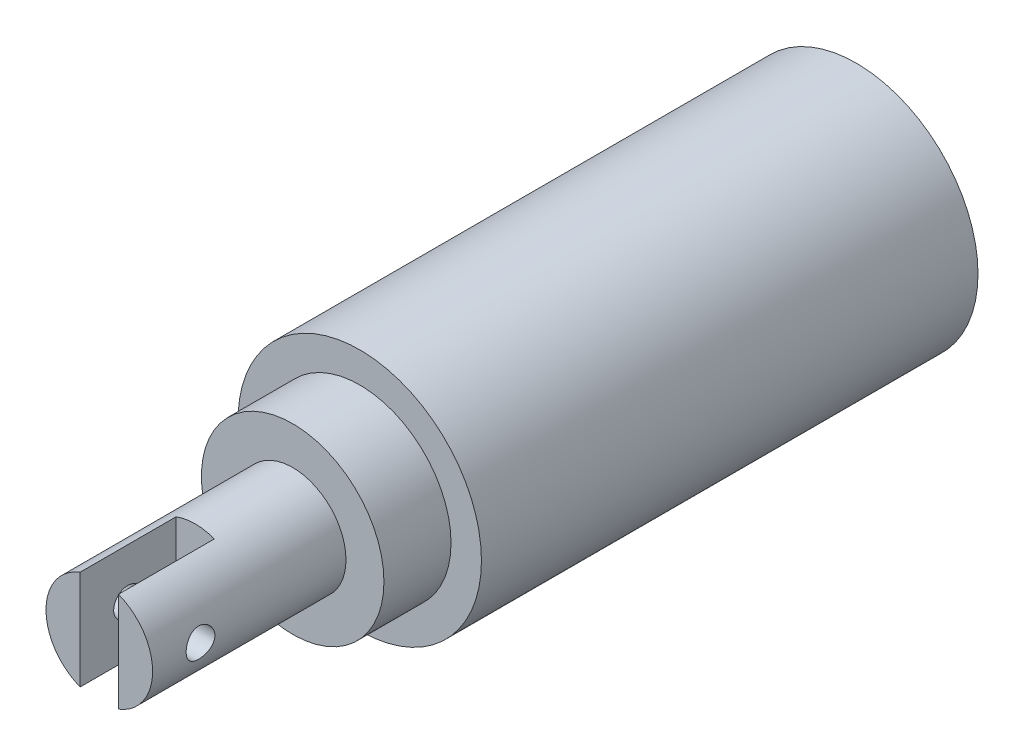
ISO-10303-21;
HEADER;
FILE_DESCRIPTION(('STEP AP214'),'2;1');
FILE_NAME('part.step','',(''),(''),'','','');
FILE_SCHEMA(('AUTOMOTIVE_DESIGN { 1 0 10303 214 1 1 1 1 }'));
ENDSEC;
DATA;
#1=APPLICATION_CONTEXT('core data for automotive mechanical design processes');
#2=APPLICATION_PROTOCOL_DEFINITION('international standard','automotive_design',2000,#1);
#3=PRODUCT_CONTEXT('',#1,'mechanical');
#4=PRODUCT('Part','Part','',(#3));
#5=PRODUCT_RELATED_PRODUCT_CATEGORY('part','',(#4));
#6=PRODUCT_DEFINITION_FORMATION('','',#4);
#7=PRODUCT_DEFINITION_CONTEXT('part definition',#1,'design');
#8=PRODUCT_DEFINITION('design','',#6,#7);
#9=PRODUCT_DEFINITION_SHAPE('','',#8);
#10=(LENGTH_UNIT() NAMED_UNIT(*) SI_UNIT(.MILLI.,.METRE.));
#11=(NAMED_UNIT(*) PLANE_ANGLE_UNIT() SI_UNIT($,.RADIAN.));
#12=(NAMED_UNIT(*) SI_UNIT($,.STERADIAN.) SOLID_ANGLE_UNIT());
#13=UNCERTAINTY_MEASURE_WITH_UNIT(LENGTH_MEASURE(1.E-05),#10,'distance_accuracy_value','');
#14=(GEOMETRIC_REPRESENTATION_CONTEXT(3) GLOBAL_UNCERTAINTY_ASSIGNED_CONTEXT((#13)) GLOBAL_UNIT_ASSIGNED_CONTEXT((#10,
#11,#12)) REPRESENTATION_CONTEXT('',''));
#15=CARTESIAN_POINT('',(0.,0.,0.));
#16=DIRECTION('',(0.,0.,1.));
#17=DIRECTION('',(1.,0.,0.));
#18=AXIS2_PLACEMENT_3D('',#15,#16,#17);
#19=CARTESIAN_POINT('',(0.,0.,78.994));
#20=DIRECTION('',(0.,0.,1.));
#21=DIRECTION('',(1.,0.,0.));
#22=AXIS2_PLACEMENT_3D('',#19,#20,#21);
#23=PLANE('',#22);
#24=DIRECTION('',(0.,1.,0.));
#25=VECTOR('',#24,1.);
#26=CARTESIAN_POINT('',(2.,0.,78.994));
#27=LINE('',#26,#25);
#28=CARTESIAN_POINT('',(2.,-5.19061834081452,78.994));
#29=VERTEX_POINT('',#28);
#30=CARTESIAN_POINT('',(2.,5.19061834081451,78.994));
#31=VERTEX_POINT('',#30);
#32=EDGE_CURVE('E81',#29,#31,#27,.T.);
#33=ORIENTED_EDGE('',*,*,#32,.F.);
#34=CARTESIAN_POINT('',(0.,0.,78.994));
#35=DIRECTION('',(0.,0.,1.));
#36=DIRECTION('',(1.,0.,0.));
#37=AXIS2_PLACEMENT_3D('',#34,#35,#36);
#38=CIRCLE('',#37,5.5626);
#39=EDGE_CURVE('E94',#29,#31,#38,.T.);
#40=ORIENTED_EDGE('',*,*,#39,.T.);
#41=EDGE_LOOP('',(#33,#40));
#42=FACE_BOUND('',#41,.T.);
#43=ADVANCED_FACE('F32',(#42),#23,.T.);
#44=CARTESIAN_POINT('',(0.,0.,58.816));
#45=DIRECTION('',(0.,0.,1.));
#46=DIRECTION('',(1.,0.,0.));
#47=AXIS2_PLACEMENT_3D('',#44,#45,#46);
#48=PLANE('',#47);
#49=CARTESIAN_POINT('',(0.,0.,58.816));
#50=DIRECTION('',(0.,0.,1.));
#51=DIRECTION('',(1.,0.,0.));
#52=AXIS2_PLACEMENT_3D('',#49,#50,#51);
#53=CIRCLE('',#52,9.525);
#54=CARTESIAN_POINT('',(9.525,0.,58.816));
#55=VERTEX_POINT('',#54);
#56=EDGE_CURVE('E97',#55,#55,#53,.T.);
#57=ORIENTED_EDGE('',*,*,#56,.T.);
#58=EDGE_LOOP('',(#57));
#59=FACE_BOUND('',#58,.T.);
#60=CARTESIAN_POINT('',(0.,0.,58.816));
#61=DIRECTION('',(0.,0.,1.));
#62=DIRECTION('',(1.,0.,0.));
#63=AXIS2_PLACEMENT_3D('',#60,#61,#62);
#64=CIRCLE('',#63,5.5626);
#65=CARTESIAN_POINT('',(5.5626,0.,58.816));
#66=VERTEX_POINT('',#65);
#67=EDGE_CURVE('E100',#66,#66,#64,.T.);
#68=ORIENTED_EDGE('',*,*,#67,.F.);
#69=EDGE_LOOP('',(#68));
#70=FACE_BOUND('',#69,.T.);
#71=ADVANCED_FACE('F118',(#59,#70),#48,.T.);
#72=CARTESIAN_POINT('',(0.,0.,51.816));
#73=DIRECTION('',(0.,0.,1.));
#74=DIRECTION('',(1.,0.,0.));
#75=AXIS2_PLACEMENT_3D('',#72,#73,#74);
#76=PLANE('',#75);
#77=CARTESIAN_POINT('',(0.,0.,51.816));
#78=DIRECTION('',(0.,0.,1.));
#79=DIRECTION('',(1.,0.,0.));
#80=AXIS2_PLACEMENT_3D('',#77,#78,#79);
#81=CIRCLE('',#80,12.7);
#82=CARTESIAN_POINT('',(12.7,0.,51.816));
#83=VERTEX_POINT('',#82);
#84=EDGE_CURVE('E82',#83,#83,#81,.T.);
#85=ORIENTED_EDGE('',*,*,#84,.T.);
#86=EDGE_LOOP('',(#85));
#87=FACE_BOUND('',#86,.T.);
#88=CARTESIAN_POINT('',(0.,0.,51.816));
#89=DIRECTION('',(0.,0.,1.));
#90=DIRECTION('',(1.,0.,0.));
#91=AXIS2_PLACEMENT_3D('',#88,#89,#90);
#92=CIRCLE('',#91,9.525);
#93=CARTESIAN_POINT('',(9.525,0.,51.816));
#94=VERTEX_POINT('',#93);
#95=EDGE_CURVE('E93',#94,#94,#92,.T.);
#96=ORIENTED_EDGE('',*,*,#95,.F.);
#97=EDGE_LOOP('',(#96));
#98=FACE_BOUND('',#97,.T.);
#99=ADVANCED_FACE('F123',(#87,#98),#76,.T.);
#100=CARTESIAN_POINT('',(0.,0.,51.816));
#101=DIRECTION('',(0.,0.,-1.));
#102=DIRECTION('',(-1.,0.,0.));
#103=AXIS2_PLACEMENT_3D('',#100,#101,#102);
#104=CYLINDRICAL_SURFACE('',#103,12.7);
#105=ORIENTED_EDGE('',*,*,#84,.F.);
#106=EDGE_LOOP('',(#105));
#107=FACE_BOUND('',#106,.T.);
#108=CARTESIAN_POINT('',(0.,0.,0.));
#109=DIRECTION('',(0.,0.,1.));
#110=DIRECTION('',(1.,0.,0.));
#111=AXIS2_PLACEMENT_3D('',#108,#109,#110);
#112=CIRCLE('',#111,12.7);
#113=CARTESIAN_POINT('',(12.7,0.,0.));
#114=VERTEX_POINT('',#113);
#115=EDGE_CURVE('E106',#114,#114,#112,.T.);
#116=ORIENTED_EDGE('',*,*,#115,.T.);
#117=EDGE_LOOP('',(#116));
#118=FACE_BOUND('',#117,.T.);
#119=ADVANCED_FACE('F34',(#107,#118),#104,.T.);
#120=CARTESIAN_POINT('',(0.,0.,0.));
#121=DIRECTION('',(0.,0.,1.));
#122=DIRECTION('',(1.,0.,0.));
#123=AXIS2_PLACEMENT_3D('',#120,#121,#122);
#124=PLANE('',#123);
#125=ORIENTED_EDGE('',*,*,#115,.F.);
#126=EDGE_LOOP('',(#125));
#127=FACE_BOUND('',#126,.T.);
#128=ADVANCED_FACE('F141',(#127),#124,.F.);
#129=CARTESIAN_POINT('',(0.,0.,58.816));
#130=DIRECTION('',(0.,0.,-1.));
#131=DIRECTION('',(-1.,0.,0.));
#132=AXIS2_PLACEMENT_3D('',#129,#130,#131);
#133=CYLINDRICAL_SURFACE('',#132,9.525);
#134=ORIENTED_EDGE('',*,*,#56,.F.);
#135=EDGE_LOOP('',(#134));
#136=FACE_BOUND('',#135,.T.);
#137=ORIENTED_EDGE('',*,*,#95,.T.);
#138=EDGE_LOOP('',(#137));
#139=FACE_BOUND('',#138,.T.);
#140=ADVANCED_FACE('F136',(#136,#139),#133,.T.);
#141=CARTESIAN_POINT('',(0.,0.,78.994));
#142=DIRECTION('',(0.,0.,-1.));
#143=DIRECTION('',(-1.,0.,0.));
#144=AXIS2_PLACEMENT_3D('',#141,#142,#143);
#145=CYLINDRICAL_SURFACE('',#144,5.5626);
#146=CARTESIAN_POINT('',(-5.5626,0.,75.4939998725515));
#147=CARTESIAN_POINT('',(-5.56259878885683,-0.0826576301759417,75.4939639086227));
#148=CARTESIAN_POINT('',(-5.56073953240274,-0.16533255188125,75.4870765444294));
#149=CARTESIAN_POINT('',(-5.55350398557009,-0.328292887135688,75.4598272199718));
#150=CARTESIAN_POINT('',(-5.54812605730109,-0.40857716967225,75.4394589845071));
#151=CARTESIAN_POINT('',(-5.53444710948873,-0.564380713451385,75.3859597298184));
#152=CARTESIAN_POINT('',(-5.52614990819609,-0.639906047724422,75.352845376532));
#153=CARTESIAN_POINT('',(-5.50750871106205,-0.78433147288741,75.2748559889954));
#154=CARTESIAN_POINT('',(-5.49716456679115,-0.853231082789052,75.2299801018071));
#155=CARTESIAN_POINT('',(-5.47527212951353,-0.984079494453268,75.1286204548856));
#156=CARTESIAN_POINT('',(-5.4637028992138,-1.04584921841725,75.0719100362681));
#157=CARTESIAN_POINT('',(-5.44079879267473,-1.15912649452822,74.9489763034858));
#158=CARTESIAN_POINT('',(-5.42946394744004,-1.21063269669256,74.8827517398745));
#159=CARTESIAN_POINT('',(-5.40809795231137,-1.30279684210612,74.741236000738));
#160=CARTESIAN_POINT('',(-5.39809322131162,-1.34324817826402,74.6658059138741));
#161=CARTESIAN_POINT('',(-5.38082897002495,-1.41082361487763,74.508901805069));
#162=CARTESIAN_POINT('',(-5.37356893052315,-1.43795023626828,74.4274289297373));
#163=CARTESIAN_POINT('',(-5.36283281714278,-1.47748327988228,74.2627383445004));
#164=CARTESIAN_POINT('',(-5.35927329594518,-1.49021491901743,74.1796042740896));
#165=CARTESIAN_POINT('',(-5.3560921889633,-1.50161021066269,74.0123099106789));
#166=CARTESIAN_POINT('',(-5.35646985120233,-1.50027654955408,73.9281498167098));
#167=CARTESIAN_POINT('',(-5.36104560699413,-1.48383769212587,73.7637329623836));
#168=CARTESIAN_POINT('',(-5.3651344902442,-1.46912614443212,73.6834333210019));
#169=CARTESIAN_POINT('',(-5.37649707808999,-1.42697922377983,73.5264863190784));
#170=CARTESIAN_POINT('',(-5.38377104308172,-1.39954281049041,73.4498392577209));
#171=CARTESIAN_POINT('',(-5.40077999104999,-1.33240412183978,73.3013469989664));
#172=CARTESIAN_POINT('',(-5.4105424076483,-1.29256394122515,73.2295674284799));
#173=CARTESIAN_POINT('',(-5.43141309646552,-1.20184498402278,73.0935743174942));
#174=CARTESIAN_POINT('',(-5.44252163865524,-1.15096399153346,73.029362299808));
#175=CARTESIAN_POINT('',(-5.46528656691391,-1.03759679143511,72.9080781711743));
#176=CARTESIAN_POINT('',(-5.47694886812647,-0.974780129014329,72.8513156106829));
#177=CARTESIAN_POINT('',(-5.49917450561272,-0.840375711360491,72.7490667050941));
#178=CARTESIAN_POINT('',(-5.5097377972528,-0.768787600153263,72.7035808178676));
#179=CARTESIAN_POINT('',(-5.52864106401177,-0.618391984653059,72.6250394812436));
#180=CARTESIAN_POINT('',(-5.53697094806067,-0.539553805397845,72.592040182293));
#181=CARTESIAN_POINT('',(-5.55039517564493,-0.377172699467378,72.5398534488958));
#182=CARTESIAN_POINT('',(-5.5554902429426,-0.293630829759463,72.5206629247268));
#183=CARTESIAN_POINT('',(-5.56176079790271,-0.126857594071182,72.4971259326668));
#184=CARTESIAN_POINT('',(-5.56304746696977,-0.0436897549588859,72.4923583119401));
#185=CARTESIAN_POINT('',(-5.56187510575181,0.12225686869626,72.4966385195759));
#186=CARTESIAN_POINT('',(-5.55941647032382,0.205035693328938,72.5056848915679));
#187=CARTESIAN_POINT('',(-5.55110080203457,0.36635103582263,72.5369915346227));
#188=CARTESIAN_POINT('',(-5.54530419365734,0.444936519800078,72.5590170170414));
#189=CARTESIAN_POINT('',(-5.53096960654614,0.597288861331062,72.6153834151502));
#190=CARTESIAN_POINT('',(-5.52243132645196,0.671055188097298,72.6497256847304));
#191=CARTESIAN_POINT('',(-5.50329961999173,0.813308094024944,72.7305285211533));
#192=CARTESIAN_POINT('',(-5.49266854181432,0.881659743608704,72.777217492558));
#193=CARTESIAN_POINT('',(-5.47057970936445,1.00970559044178,72.8811014824177));
#194=CARTESIAN_POINT('',(-5.4591217882523,1.06939803308779,72.9382986248222));
#195=CARTESIAN_POINT('',(-5.4362598792577,1.18020999847654,73.0635413020884));
#196=CARTESIAN_POINT('',(-5.42486699692728,1.23103229248421,73.1318523426426));
#197=CARTESIAN_POINT('',(-5.40378761202352,1.32049948324511,73.2762758482768));
#198=CARTESIAN_POINT('',(-5.39410103852929,1.35914488617042,73.3523879889045));
#199=CARTESIAN_POINT('',(-5.37764346650667,1.42286793028129,73.5098747579032));
#200=CARTESIAN_POINT('',(-5.37085557409625,1.44802441259334,73.5912156239507));
#201=CARTESIAN_POINT('',(-5.36096196626287,1.4842387666175,73.7571878839676));
#202=CARTESIAN_POINT('',(-5.35785528329691,1.49530034299239,73.8418184072644));
#203=CARTESIAN_POINT('',(-5.35575730515717,1.50279580147522,74.0089176673579));
#204=CARTESIAN_POINT('',(-5.35663131202301,1.49970843103429,74.0913635604228));
#205=CARTESIAN_POINT('',(-5.36208043660348,1.48010591177639,74.2545122788577));
#206=CARTESIAN_POINT('',(-5.36665545623014,1.46359111882649,74.3352151503648));
#207=CARTESIAN_POINT('',(-5.37891053794456,1.41788188068756,74.4919744274599));
#208=CARTESIAN_POINT('',(-5.38656538730357,1.38879025379561,74.5680629237575));
#209=CARTESIAN_POINT('',(-5.40411818154239,1.31883290333707,74.7143374185049));
#210=CARTESIAN_POINT('',(-5.41401648593075,1.27796529241071,74.7845224684666));
#211=CARTESIAN_POINT('',(-5.43531324317007,1.18417221706632,74.9192785178083));
#212=CARTESIAN_POINT('',(-5.44674787158157,1.1309209538839,74.9836170649776));
#213=CARTESIAN_POINT('',(-5.46962911131907,1.01449010326539,75.102600332744));
#214=CARTESIAN_POINT('',(-5.48107572488992,0.951308093702968,75.1572426814814));
#215=CARTESIAN_POINT('',(-5.50299313256256,0.815131362367167,75.2564659759008));
#216=CARTESIAN_POINT('',(-5.51343690422235,0.741951273278076,75.300799003733));
#217=CARTESIAN_POINT('',(-5.53187512708696,0.588897026880496,75.3764635260885));
#218=CARTESIAN_POINT('',(-5.53987111489839,0.509027109417207,75.4078031816531));
#219=CARTESIAN_POINT('',(-5.55150729530645,0.357902002702741,75.4526101158332));
#220=CARTESIAN_POINT('',(-5.55563654089783,0.287283650880205,75.4681208241352));
#221=CARTESIAN_POINT('',(-5.56118328199961,0.144447823138649,75.4888308821026));
#222=CARTESIAN_POINT('',(-5.56260105835956,0.0722305136209735,75.4940312996932));
#223=CARTESIAN_POINT('',(-5.5626,0.,75.4939998725515));
#224=B_SPLINE_CURVE_WITH_KNOTS('',3,(#146,#147,#148,#149,#150,#151,#152,#153,#154,#155,#156,
#157,#158,#159,#160,#161,#162,#163,#164,#165,#166,#167,#168,#169,#170,#171,#172,#173,#174,#175,
#176,#177,#178,#179,#180,#181,#182,#183,#184,#185,#186,#187,#188,#189,#190,#191,#192,#193,#194,
#195,#196,#197,#198,#199,#200,#201,#202,#203,#204,#205,#206,#207,#208,#209,#210,#211,#212,#213,
#214,#215,#216,#217,#218,#219,#220,#221,#222,#223),.UNSPECIFIED.,.T.,.F.,(4,2,2,2,2,2,2,2,2,2,2,
2,2,2,2,2,2,2,2,2,2,2,2,2,2,2,2,2,2,2,2,2,2,2,2,2,2,2,4),(0.,0.247707982811567,
0.495531352191529,0.743031779701427,0.990550160733333,1.24333483660834,1.49615273986876,
1.75341471011196,2.01062798957795,2.26190622467293,2.51313646812146,2.75720525980108,
3.00129400902547,3.24819977231083,3.49515513573,3.75034681757231,4.00554885936278,
4.26188524320237,4.51816425375996,4.76688389832056,5.01557732287576,5.25990436916177,
5.5042582806871,5.75349416576279,6.0027804828339,6.25926320361729,6.5157352614552,
6.77069146252464,7.02558063783915,7.27191021806889,7.51823327003688,7.76257956952486,
8.00696505267063,8.25870358117576,8.51050360469723,8.76784565430865,9.0250258235128,
9.2415082984241,9.4579683492193),.UNSPECIFIED.);
#225=CARTESIAN_POINT('',(-5.5626,0.,75.4939998725515));
#226=VERTEX_POINT('',#225);
#227=EDGE_CURVE('E155',#226,#226,#224,.T.);
#228=ORIENTED_EDGE('',*,*,#227,.T.);
#229=EDGE_LOOP('',(#228));
#230=FACE_BOUND('',#229,.T.);
#231=CARTESIAN_POINT('',(5.35671292866233,-1.49938165918548,73.994));
#232=CARTESIAN_POINT('',(5.35671432509439,-1.49937973909227,74.0765965570103));
#233=CARTESIAN_POINT('',(5.35864339042002,-1.49253623127147,74.1592132837374));
#234=CARTESIAN_POINT('',(5.36612744411516,-1.46539642183984,74.3220582989403));
#235=CARTESIAN_POINT('',(5.37168419808059,-1.44509356949217,74.4022854044966));
#236=CARTESIAN_POINT('',(5.38574938428053,-1.39175288027278,74.5579718409183));
#237=CARTESIAN_POINT('',(5.3942536033936,-1.358733213428,74.6334377963681));
#238=CARTESIAN_POINT('',(5.41324980615419,-1.28095333853473,74.7777714204247));
#239=CARTESIAN_POINT('',(5.4237419567674,-1.23619214419787,74.846638534065));
#240=CARTESIAN_POINT('',(5.44583189210419,-1.13497644256846,74.9775795320862));
#241=CARTESIAN_POINT('',(5.45744961437074,-1.07827576504349,75.0394598071511));
#242=CARTESIAN_POINT('',(5.48030901883887,-0.955319848989979,75.1529579229367));
#243=CARTESIAN_POINT('',(5.49155066126767,-0.889063603811856,75.2045746810631));
#244=CARTESIAN_POINT('',(5.51261344876183,-0.747532975255472,75.2968898641333));
#245=CARTESIAN_POINT('',(5.52240830625646,-0.672128637674939,75.337395572105));
#246=CARTESIAN_POINT('',(5.53924416743426,-0.515271714492883,75.4050811482633));
#247=CARTESIAN_POINT('',(5.54628564648543,-0.433820175826403,75.4322633169511));
#248=CARTESIAN_POINT('',(5.55667952859189,-0.269204197801758,75.4719020397412));
#249=CARTESIAN_POINT('',(5.56011441017254,-0.18612445600744,75.4846883285186));
#250=CARTESIAN_POINT('',(5.56319564224544,-0.0189329005207789,75.496210395242));
#251=CARTESIAN_POINT('',(5.56284264003287,0.0651787343820285,75.4949485738079));
#252=CARTESIAN_POINT('',(5.55844753086631,0.229752225525179,75.4786415181891));
#253=CARTESIAN_POINT('',(5.5545007013558,0.310252283278929,75.4639522263396));
#254=CARTESIAN_POINT('',(5.54347307704919,0.467599280355665,75.4217829798543));
#255=CARTESIAN_POINT('',(5.53639210113891,0.544446008277966,75.3943022860319));
#256=CARTESIAN_POINT('',(5.51975010061885,0.693211187735217,75.3270591997721));
#257=CARTESIAN_POINT('',(5.51016469680913,0.7650718774177,75.2871752993457));
#258=CARTESIAN_POINT('',(5.48954479966244,0.901201220559811,75.1963514453265));
#259=CARTESIAN_POINT('',(5.47851001840455,0.965468360718677,75.1454092936804));
#260=CARTESIAN_POINT('',(5.45577680796723,1.08671355122566,75.0320267450846));
#261=CARTESIAN_POINT('',(5.44406841962285,1.14339954308056,74.9692756648398));
#262=CARTESIAN_POINT('',(5.4216188296183,1.24551561741697,74.8350369408465));
#263=CARTESIAN_POINT('',(5.41087768967557,1.29094498196777,74.7635487402917));
#264=CARTESIAN_POINT('',(5.39153776592982,1.36948647366317,74.6132217298777));
#265=CARTESIAN_POINT('',(5.38295316244763,1.40251774402062,74.5343387216281));
#266=CARTESIAN_POINT('',(5.36907356377447,1.45475304075855,74.3718492786313));
#267=CARTESIAN_POINT('',(5.36377773078085,1.47396058888167,74.2882440527779));
#268=CARTESIAN_POINT('',(5.35725401295617,1.49749586569253,74.1214208333145));
#269=CARTESIAN_POINT('',(5.35590679140781,1.50226025927835,74.0382690431578));
#270=CARTESIAN_POINT('',(5.35710598377842,1.49797845733558,73.8723565780985));
#271=CARTESIAN_POINT('',(5.35965197240485,1.48893377030494,73.7895958614658));
#272=CARTESIAN_POINT('',(5.36823540976348,1.45767575765647,73.6285082096932));
#273=CARTESIAN_POINT('',(5.3742028175074,1.43572638540281,73.5501259595875));
#274=CARTESIAN_POINT('',(5.38888814556919,1.3795796312586,73.3981559159977));
#275=CARTESIAN_POINT('',(5.39760643116805,1.3453806226932,73.3245687608067));
#276=CARTESIAN_POINT('',(5.41705520641697,1.26482420860316,73.1824557176245));
#277=CARTESIAN_POINT('',(5.4278264385299,1.21821132909678,73.1140803498051));
#278=CARTESIAN_POINT('',(5.45007279633168,1.11446594714713,72.9859618236739));
#279=CARTESIAN_POINT('',(5.46154805725717,1.05733141935879,72.9262203312822));
#280=CARTESIAN_POINT('',(5.48432208058348,0.932142118594365,72.8152445446383));
#281=CARTESIAN_POINT('',(5.49560550878289,0.863813675603267,72.7643151897016));
#282=CARTESIAN_POINT('',(5.51637648705655,0.719324841862968,72.6746484076629));
#283=CARTESIAN_POINT('',(5.52586413248833,0.643164867306121,72.6359103331215));
#284=CARTESIAN_POINT('',(5.54191423430164,0.485709583542036,72.5720836397667));
#285=CARTESIAN_POINT('',(5.5484985069996,0.404458002804045,72.5468928984989));
#286=CARTESIAN_POINT('',(5.55809687901337,0.238670270660453,72.5105823727164));
#287=CARTESIAN_POINT('',(5.56111178903145,0.154134869609242,72.4994593929796));
#288=CARTESIAN_POINT('',(5.56319296106394,-0.0129763752239646,72.4918042376153));
#289=CARTESIAN_POINT('',(5.56238007930811,-0.0955305418473847,72.4948254641531));
#290=CARTESIAN_POINT('',(5.55717236575273,-0.258910513526011,72.5143335955746));
#291=CARTESIAN_POINT('',(5.55277767440246,-0.339736386223246,72.5308199724653));
#292=CARTESIAN_POINT('',(5.54092593933781,-0.496813315050268,72.5765352566155));
#293=CARTESIAN_POINT('',(5.53349120124367,-0.573093151335601,72.6056714431448));
#294=CARTESIAN_POINT('',(5.51633667375359,-0.719725078768089,72.6757768972457));
#295=CARTESIAN_POINT('',(5.50661655866501,-0.790076323079379,72.7167478515987));
#296=CARTESIAN_POINT('',(5.4856013230548,-0.924923582750367,72.8106553075623));
#297=CARTESIAN_POINT('',(5.47427062814841,-0.989208975247938,72.8638862676477));
#298=CARTESIAN_POINT('',(5.451452687688,-1.10808572747273,72.980246658615));
#299=CARTESIAN_POINT('',(5.43996540143506,-1.16267451320576,73.0433787094227));
#300=CARTESIAN_POINT('',(5.41783538302703,-1.26183342499215,73.1794678808955));
#301=CARTESIAN_POINT('',(5.40721765076694,-1.30614882898065,73.2526150364232));
#302=CARTESIAN_POINT('',(5.38838589722096,-1.38179073383486,73.4055988389964));
#303=CARTESIAN_POINT('',(5.38017033919094,-1.41312554415393,73.4854311670921));
#304=CARTESIAN_POINT('',(5.36818660251395,-1.45792221483904,73.636448192625));
#305=CARTESIAN_POINT('',(5.36391926586154,-1.4734325016558,73.7069921530026));
#306=CARTESIAN_POINT('',(5.35818198668338,-1.49416244541622,73.8496857391324));
#307=CARTESIAN_POINT('',(5.35671170859598,-1.49938333677596,73.9218351712262));
#308=CARTESIAN_POINT('',(5.35671292866233,-1.49938165918548,73.994));
#309=B_SPLINE_CURVE_WITH_KNOTS('',3,(#231,#232,#233,#234,#235,#236,#237,#238,#239,#240,#241,
#242,#243,#244,#245,#246,#247,#248,#249,#250,#251,#252,#253,#254,#255,#256,#257,#258,#259,#260,
#261,#262,#263,#264,#265,#266,#267,#268,#269,#270,#271,#272,#273,#274,#275,#276,#277,#278,#279,
#280,#281,#282,#283,#284,#285,#286,#287,#288,#289,#290,#291,#292,#293,#294,#295,#296,#297,#298,
#299,#300,#301,#302,#303,#304,#305,#306,#307,#308),.UNSPECIFIED.,.T.,.F.,(4,2,2,2,2,2,2,2,2,2,2,
2,2,2,2,2,2,2,2,2,2,2,2,2,2,2,2,2,2,2,2,2,2,2,2,2,2,2,4),(0.,0.247524247284614,
0.495169054512628,0.74246132705065,0.989774378796566,1.24279881335663,1.49584992275722,
1.75304652451436,2.01019870191235,2.26133276980448,2.51242392315775,2.75704616506803,
3.00168254490824,3.24879530458049,3.49595722801166,3.75087602511067,4.00581107636332,
4.26238098637201,4.51888550926335,4.76755357818128,5.0161944846512,5.25991839577184,
5.503674683905,5.75289766447949,6.00216866900777,6.25883429869451,6.51548629540034,
6.77017547108522,7.02480678861712,7.27145343421723,7.51809040881792,7.76294931976157,
8.00784314710349,8.25938067532078,8.51098487549023,8.7682837642233,9.02541768905688,
9.24170622361292,9.45796880851024),.UNSPECIFIED.);
#310=CARTESIAN_POINT('',(5.35671292866233,-1.49938165918548,73.994));
#311=VERTEX_POINT('',#310);
#312=EDGE_CURVE('E149',#311,#311,#309,.T.);
#313=ORIENTED_EDGE('',*,*,#312,.T.);
#314=EDGE_LOOP('',(#313));
#315=FACE_BOUND('',#314,.T.);
#316=CARTESIAN_POINT('',(0.,0.,68.994));
#317=DIRECTION('',(0.,0.,-1.));
#318=DIRECTION('',(-1.,0.,0.));
#319=AXIS2_PLACEMENT_3D('',#316,#317,#318);
#320=CIRCLE('',#319,5.5626);
#321=CARTESIAN_POINT('',(-2.,5.19061834081451,68.994));
#322=VERTEX_POINT('',#321);
#323=CARTESIAN_POINT('',(2.,5.19061834081451,68.994));
#324=VERTEX_POINT('',#323);
#325=EDGE_CURVE('E11',#322,#324,#320,.T.);
#326=ORIENTED_EDGE('',*,*,#325,.T.);
#327=DIRECTION('',(0.,0.,-1.));
#328=VECTOR('',#327,1.);
#329=CARTESIAN_POINT('',(2.,5.19061834081451,78.994));
#330=LINE('',#329,#328);
#331=EDGE_CURVE('E56',#324,#31,#330,.F.);
#332=ORIENTED_EDGE('',*,*,#331,.T.);
#333=ORIENTED_EDGE('',*,*,#39,.F.);
#334=DIRECTION('',(0.,0.,-1.));
#335=VECTOR('',#334,1.);
#336=CARTESIAN_POINT('',(2.,-5.19061834081451,78.994));
#337=LINE('',#336,#335);
#338=CARTESIAN_POINT('',(2.,-5.19061834081451,68.994));
#339=VERTEX_POINT('',#338);
#340=EDGE_CURVE('E113',#29,#339,#337,.T.);
#341=ORIENTED_EDGE('',*,*,#340,.T.);
#342=CARTESIAN_POINT('',(-2.,-5.19061834081451,68.994));
#343=VERTEX_POINT('',#342);
#344=EDGE_CURVE('E41',#339,#343,#320,.T.);
#345=ORIENTED_EDGE('',*,*,#344,.T.);
#346=DIRECTION('',(0.,0.,-1.));
#347=VECTOR('',#346,1.);
#348=CARTESIAN_POINT('',(-2.,-5.19061834081451,78.994));
#349=LINE('',#348,#347);
#350=CARTESIAN_POINT('',(-2.,-5.19061834081451,78.994));
#351=VERTEX_POINT('',#350);
#352=EDGE_CURVE('E76',#343,#351,#349,.F.);
#353=ORIENTED_EDGE('',*,*,#352,.T.);
#354=CARTESIAN_POINT('',(-2.,5.19061834081451,78.994));
#355=VERTEX_POINT('',#354);
#356=EDGE_CURVE('E88',#355,#351,#38,.T.);
#357=ORIENTED_EDGE('',*,*,#356,.F.);
#358=DIRECTION('',(0.,0.,-1.));
#359=VECTOR('',#358,1.);
#360=CARTESIAN_POINT('',(-2.,5.19061834081451,78.994));
#361=LINE('',#360,#359);
#362=EDGE_CURVE('E48',#355,#322,#361,.T.);
#363=ORIENTED_EDGE('',*,*,#362,.T.);
#364=EDGE_LOOP('',(#326,#332,#333,#341,#345,#353,#357,#363));
#365=FACE_BOUND('',#364,.T.);
#366=ORIENTED_EDGE('',*,*,#67,.T.);
#367=EDGE_LOOP('',(#366));
#368=FACE_BOUND('',#367,.T.);
#369=ADVANCED_FACE('F86',(#230,#315,#365,#368),#145,.T.);
#370=DIRECTION('',(0.,-1.,0.));
#371=VECTOR('',#370,1.);
#372=CARTESIAN_POINT('',(-2.,0.,78.994));
#373=LINE('',#372,#371);
#374=EDGE_CURVE('E73',#355,#351,#373,.T.);
#375=ORIENTED_EDGE('',*,*,#374,.F.);
#376=ORIENTED_EDGE('',*,*,#356,.T.);
#377=EDGE_LOOP('',(#375,#376));
#378=FACE_BOUND('',#377,.T.);
#379=ADVANCED_FACE('F92',(#378),#23,.T.);
#380=CARTESIAN_POINT('',(2.,-6.,68.994));
#381=DIRECTION('',(0.,0.,-1.));
#382=DIRECTION('',(-1.,0.,0.));
#383=AXIS2_PLACEMENT_3D('',#380,#381,#382);
#384=PLANE('',#383);
#385=DIRECTION('',(0.,-1.,0.));
#386=VECTOR('',#385,1.);
#387=CARTESIAN_POINT('',(-2.,6.,68.994));
#388=LINE('',#387,#386);
#389=EDGE_CURVE('E90',#322,#343,#388,.T.);
#390=ORIENTED_EDGE('',*,*,#389,.T.);
#391=ORIENTED_EDGE('',*,*,#344,.F.);
#392=DIRECTION('',(0.,1.,0.));
#393=VECTOR('',#392,1.);
#394=CARTESIAN_POINT('',(2.,6.,68.994));
#395=LINE('',#394,#393);
#396=EDGE_CURVE('E159',#339,#324,#395,.T.);
#397=ORIENTED_EDGE('',*,*,#396,.T.);
#398=ORIENTED_EDGE('',*,*,#325,.F.);
#399=EDGE_LOOP('',(#390,#391,#397,#398));
#400=FACE_BOUND('',#399,.T.);
#401=ADVANCED_FACE('F129',(#400),#384,.F.);
#402=CARTESIAN_POINT('',(2.,6.,68.994));
#403=DIRECTION('',(1.,0.,0.));
#404=DIRECTION('',(0.,1.,0.));
#405=AXIS2_PLACEMENT_3D('',#402,#403,#404);
#406=PLANE('',#405);
#407=CARTESIAN_POINT('',(2.,0.000618340814513953,73.994));
#408=DIRECTION('',(1.,0.,0.));
#409=DIRECTION('',(0.,1.,0.));
#410=AXIS2_PLACEMENT_3D('',#407,#408,#409);
#411=CIRCLE('',#410,1.5);
#412=CARTESIAN_POINT('',(2.,1.50061834081451,73.994));
#413=VERTEX_POINT('',#412);
#414=EDGE_CURVE('E176',#413,#413,#411,.T.);
#415=ORIENTED_EDGE('',*,*,#414,.T.);
#416=EDGE_LOOP('',(#415));
#417=FACE_BOUND('',#416,.T.);
#418=ORIENTED_EDGE('',*,*,#32,.T.);
#419=ORIENTED_EDGE('',*,*,#331,.F.);
#420=ORIENTED_EDGE('',*,*,#396,.F.);
#421=ORIENTED_EDGE('',*,*,#340,.F.);
#422=EDGE_LOOP('',(#418,#419,#420,#421));
#423=FACE_BOUND('',#422,.T.);
#424=ADVANCED_FACE('F112',(#417,#423),#406,.F.);
#425=CARTESIAN_POINT('',(-2.,6.,68.994));
#426=DIRECTION('',(-1.,0.,0.));
#427=DIRECTION('',(0.,-1.,0.));
#428=AXIS2_PLACEMENT_3D('',#425,#426,#427);
#429=PLANE('',#428);
#430=CARTESIAN_POINT('',(-2.,0.000618340814513519,73.994));
#431=DIRECTION('',(-1.,0.,0.));
#432=DIRECTION('',(0.,-1.,0.));
#433=AXIS2_PLACEMENT_3D('',#430,#431,#432);
#434=CIRCLE('',#433,1.5);
#435=CARTESIAN_POINT('',(-2.,-1.49938165918548,73.994));
#436=VERTEX_POINT('',#435);
#437=EDGE_CURVE('E36',#436,#436,#434,.T.);
#438=ORIENTED_EDGE('',*,*,#437,.T.);
#439=EDGE_LOOP('',(#438));
#440=FACE_BOUND('',#439,.T.);
#441=ORIENTED_EDGE('',*,*,#374,.T.);
#442=ORIENTED_EDGE('',*,*,#352,.F.);
#443=ORIENTED_EDGE('',*,*,#389,.F.);
#444=ORIENTED_EDGE('',*,*,#362,.F.);
#445=EDGE_LOOP('',(#441,#442,#443,#444));
#446=FACE_BOUND('',#445,.T.);
#447=ADVANCED_FACE('F75',(#440,#446),#429,.F.);
#448=CARTESIAN_POINT('',(12.,0.000618340814515037,73.994));
#449=DIRECTION('',(-1.,0.,0.));
#450=DIRECTION('',(0.,-1.,0.));
#451=AXIS2_PLACEMENT_3D('',#448,#449,#450);
#452=CYLINDRICAL_SURFACE('',#451,1.5);
#453=ORIENTED_EDGE('',*,*,#437,.F.);
#454=EDGE_LOOP('',(#453));
#455=FACE_BOUND('',#454,.T.);
#456=ORIENTED_EDGE('',*,*,#227,.F.);
#457=EDGE_LOOP('',(#456));
#458=FACE_BOUND('',#457,.T.);
#459=ADVANCED_FACE('F161',(#455,#458),#452,.F.);
#460=ORIENTED_EDGE('',*,*,#414,.F.);
#461=EDGE_LOOP('',(#460));
#462=FACE_BOUND('',#461,.T.);
#463=ORIENTED_EDGE('',*,*,#312,.F.);
#464=EDGE_LOOP('',(#463));
#465=FACE_BOUND('',#464,.T.);
#466=ADVANCED_FACE('F164',(#462,#465),#452,.F.);
#467=CLOSED_SHELL('',(#43,#71,#99,#119,#128,#140,#369,#379,#401,#424,#447,#459,#466));
#468=MANIFOLD_SOLID_BREP('B2',#467);
#469=ADVANCED_BREP_SHAPE_REPRESENTATION('',(#18,#468),#14);
#470=SHAPE_DEFINITION_REPRESENTATION(#9,#469);
ENDSEC;
END-ISO-10303-21;
